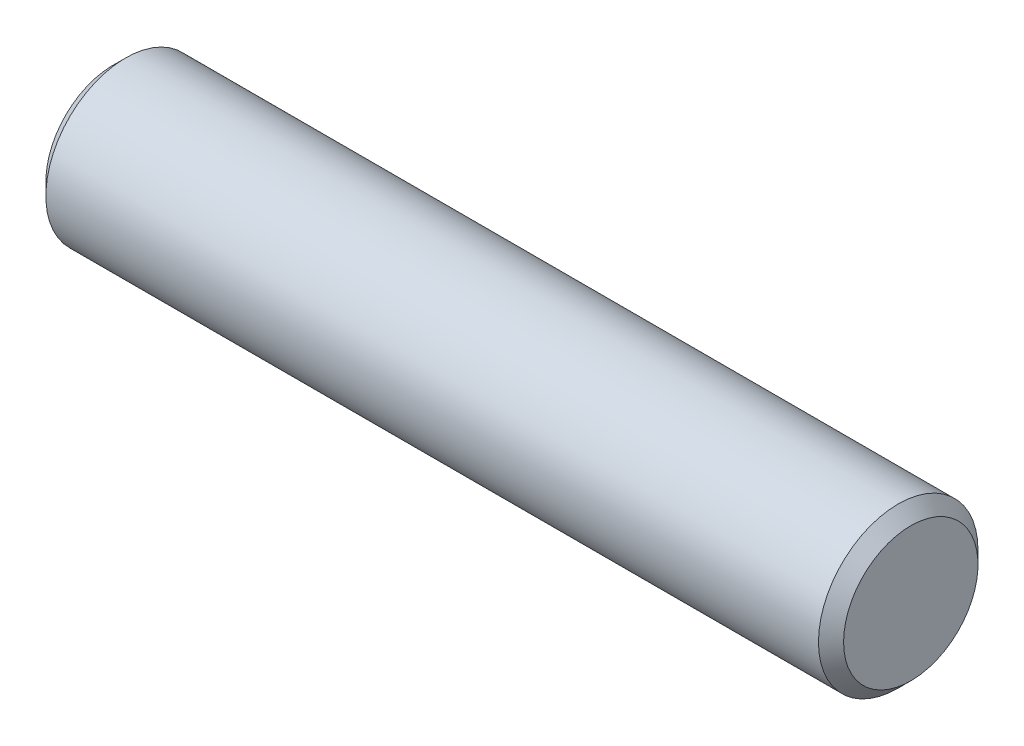
ISO-10303-21;
HEADER;
FILE_DESCRIPTION(('STEP AP214'),'2;1');
FILE_NAME('part.step','',(''),(''),'','','');
FILE_SCHEMA(('AUTOMOTIVE_DESIGN { 1 0 10303 214 1 1 1 1 }'));
ENDSEC;
DATA;
#1=APPLICATION_CONTEXT('core data for automotive mechanical design processes');
#2=APPLICATION_PROTOCOL_DEFINITION('international standard','automotive_design',2000,#1);
#3=PRODUCT_CONTEXT('',#1,'mechanical');
#4=PRODUCT('Part','Part','',(#3));
#5=PRODUCT_RELATED_PRODUCT_CATEGORY('part','',(#4));
#6=PRODUCT_DEFINITION_FORMATION('','',#4);
#7=PRODUCT_DEFINITION_CONTEXT('part definition',#1,'design');
#8=PRODUCT_DEFINITION('design','',#6,#7);
#9=PRODUCT_DEFINITION_SHAPE('','',#8);
#10=(LENGTH_UNIT() NAMED_UNIT(*) SI_UNIT(.MILLI.,.METRE.));
#11=(NAMED_UNIT(*) PLANE_ANGLE_UNIT() SI_UNIT($,.RADIAN.));
#12=(NAMED_UNIT(*) SI_UNIT($,.STERADIAN.) SOLID_ANGLE_UNIT());
#13=UNCERTAINTY_MEASURE_WITH_UNIT(LENGTH_MEASURE(1.E-05),#10,'distance_accuracy_value','');
#14=(GEOMETRIC_REPRESENTATION_CONTEXT(3) GLOBAL_UNCERTAINTY_ASSIGNED_CONTEXT((#13)) GLOBAL_UNIT_ASSIGNED_CONTEXT((#10,
#11,#12)) REPRESENTATION_CONTEXT('',''));
#15=CARTESIAN_POINT('',(0.,0.,0.));
#16=DIRECTION('',(0.,0.,1.));
#17=DIRECTION('',(1.,0.,0.));
#18=AXIS2_PLACEMENT_3D('',#15,#16,#17);
#19=CARTESIAN_POINT('',(15.875,50.8,-23.575));
#20=DIRECTION('',(1.,0.,0.));
#21=DIRECTION('',(0.,0.,-1.));
#22=AXIS2_PLACEMENT_3D('',#19,#20,#21);
#23=PLANE('',#22);
#24=CARTESIAN_POINT('',(15.8749999999941,50.8,-23.575));
#25=DIRECTION('',(-1.,0.,0.));
#26=DIRECTION('',(0.,0.,1.));
#27=AXIS2_PLACEMENT_3D('',#24,#25,#26);
#28=CIRCLE('',#27,2.67499999999173);
#29=CARTESIAN_POINT('',(15.8749999999941,50.8,-20.9000000000083));
#30=VERTEX_POINT('',#29);
#31=EDGE_CURVE('E17',#30,#30,#28,.T.);
#32=ORIENTED_EDGE('',*,*,#31,.F.);
#33=EDGE_LOOP('',(#32));
#34=FACE_BOUND('',#33,.T.);
#35=ADVANCED_FACE('F14',(#34),#23,.T.);
#36=CARTESIAN_POINT('',(-15.875,50.8,-23.575));
#37=DIRECTION('',(1.,0.,0.));
#38=DIRECTION('',(0.,0.,-1.));
#39=AXIS2_PLACEMENT_3D('',#36,#37,#38);
#40=PLANE('',#39);
#41=CARTESIAN_POINT('',(-15.8749999999941,50.8,-23.575));
#42=DIRECTION('',(1.,0.,0.));
#43=DIRECTION('',(0.,0.,-1.));
#44=AXIS2_PLACEMENT_3D('',#41,#42,#43);
#45=CIRCLE('',#44,2.67499999999173);
#46=CARTESIAN_POINT('',(-15.8749999999941,50.8,-26.2499999999917));
#47=VERTEX_POINT('',#46);
#48=EDGE_CURVE('E26',#47,#47,#45,.T.);
#49=ORIENTED_EDGE('',*,*,#48,.F.);
#50=EDGE_LOOP('',(#49));
#51=FACE_BOUND('',#50,.T.);
#52=ADVANCED_FACE('F37',(#51),#40,.F.);
#53=CARTESIAN_POINT('',(15.3750000000059,50.8,-23.575));
#54=DIRECTION('',(-1.,0.,0.));
#55=DIRECTION('',(0.,0.,1.));
#56=AXIS2_PLACEMENT_3D('',#53,#54,#55);
#57=CONICAL_SURFACE('',#56,3.1749999999799,0.785398163397448);
#58=CARTESIAN_POINT('',(15.375,50.8,-23.575));
#59=DIRECTION('',(1.,0.,0.));
#60=DIRECTION('',(0.,0.,-1.));
#61=AXIS2_PLACEMENT_3D('',#58,#59,#60);
#62=CIRCLE('',#61,3.175);
#63=CARTESIAN_POINT('',(15.375,50.8,-26.75));
#64=VERTEX_POINT('',#63);
#65=EDGE_CURVE('E21',#64,#64,#62,.F.);
#66=ORIENTED_EDGE('',*,*,#65,.F.);
#67=EDGE_LOOP('',(#66));
#68=FACE_BOUND('',#67,.T.);
#69=ORIENTED_EDGE('',*,*,#31,.T.);
#70=EDGE_LOOP('',(#69));
#71=FACE_BOUND('',#70,.T.);
#72=ADVANCED_FACE('F34',(#68,#71),#57,.T.);
#73=CARTESIAN_POINT('',(-15.3750000000059,50.8,-23.575));
#74=DIRECTION('',(1.,0.,0.));
#75=DIRECTION('',(0.,0.,-1.));
#76=AXIS2_PLACEMENT_3D('',#73,#74,#75);
#77=CONICAL_SURFACE('',#76,3.1749999999799,0.785398163397448);
#78=CARTESIAN_POINT('',(-15.375,50.8,-23.575));
#79=DIRECTION('',(1.,0.,0.));
#80=DIRECTION('',(0.,0.,-1.));
#81=AXIS2_PLACEMENT_3D('',#78,#79,#80);
#82=CIRCLE('',#81,3.175);
#83=CARTESIAN_POINT('',(-15.375,50.8,-26.75));
#84=VERTEX_POINT('',#83);
#85=EDGE_CURVE('E10',#84,#84,#82,.T.);
#86=ORIENTED_EDGE('',*,*,#85,.F.);
#87=EDGE_LOOP('',(#86));
#88=FACE_BOUND('',#87,.T.);
#89=ORIENTED_EDGE('',*,*,#48,.T.);
#90=EDGE_LOOP('',(#89));
#91=FACE_BOUND('',#90,.T.);
#92=ADVANCED_FACE('F45',(#88,#91),#77,.T.);
#93=CARTESIAN_POINT('',(0.,50.8,-23.575));
#94=DIRECTION('',(1.,0.,0.));
#95=DIRECTION('',(0.,0.,-1.));
#96=AXIS2_PLACEMENT_3D('',#93,#94,#95);
#97=CYLINDRICAL_SURFACE('',#96,3.175);
#98=ORIENTED_EDGE('',*,*,#85,.T.);
#99=EDGE_LOOP('',(#98));
#100=FACE_BOUND('',#99,.T.);
#101=ORIENTED_EDGE('',*,*,#65,.T.);
#102=EDGE_LOOP('',(#101));
#103=FACE_BOUND('',#102,.T.);
#104=ADVANCED_FACE('F43',(#100,#103),#97,.T.);
#105=CLOSED_SHELL('',(#35,#52,#72,#92,#104));
#106=MANIFOLD_SOLID_BREP('B1',#105);
#107=ADVANCED_BREP_SHAPE_REPRESENTATION('',(#18,#106),#14);
#108=SHAPE_DEFINITION_REPRESENTATION(#9,#107);
ENDSEC;
END-ISO-10303-21;
